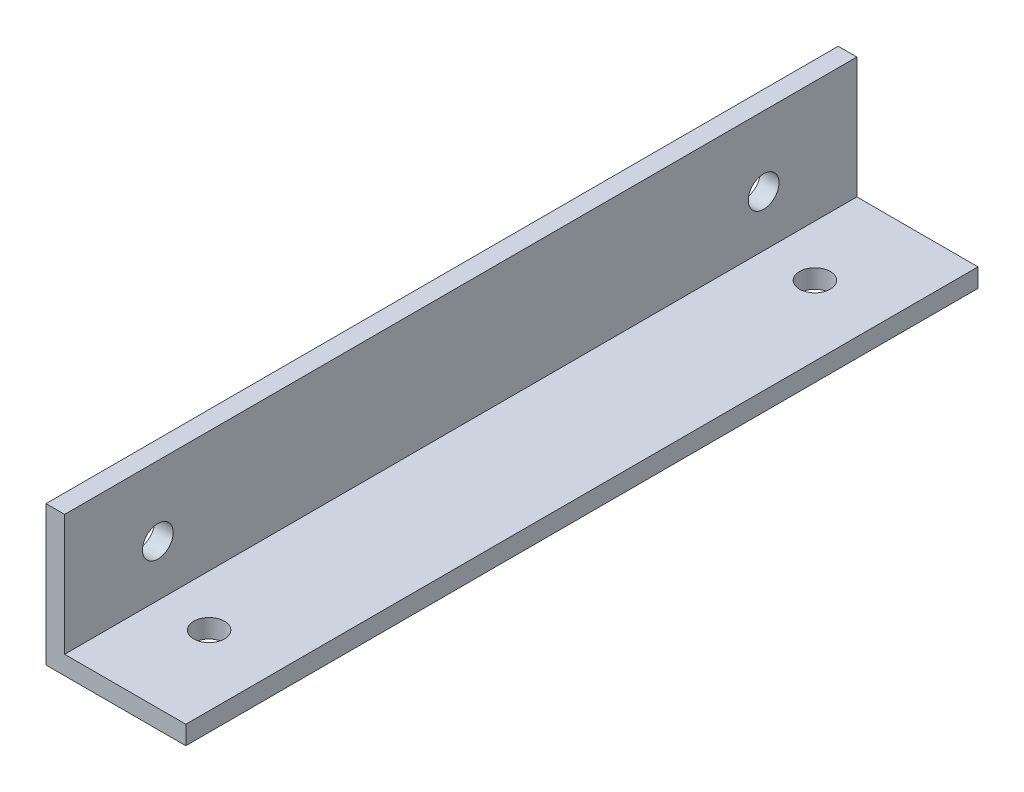
ISO-10303-21;
HEADER;
FILE_DESCRIPTION(('STEP AP214'),'2;1');
FILE_NAME('part.step','',(''),(''),'','','');
FILE_SCHEMA(('AUTOMOTIVE_DESIGN { 1 0 10303 214 1 1 1 1 }'));
ENDSEC;
DATA;
#1=APPLICATION_CONTEXT('core data for automotive mechanical design processes');
#2=APPLICATION_PROTOCOL_DEFINITION('international standard','automotive_design',2000,#1);
#3=PRODUCT_CONTEXT('',#1,'mechanical');
#4=PRODUCT('Part','Part','',(#3));
#5=PRODUCT_RELATED_PRODUCT_CATEGORY('part','',(#4));
#6=PRODUCT_DEFINITION_FORMATION('','',#4);
#7=PRODUCT_DEFINITION_CONTEXT('part definition',#1,'design');
#8=PRODUCT_DEFINITION('design','',#6,#7);
#9=PRODUCT_DEFINITION_SHAPE('','',#8);
#10=(LENGTH_UNIT() NAMED_UNIT(*) SI_UNIT(.MILLI.,.METRE.));
#11=(NAMED_UNIT(*) PLANE_ANGLE_UNIT() SI_UNIT($,.RADIAN.));
#12=(NAMED_UNIT(*) SI_UNIT($,.STERADIAN.) SOLID_ANGLE_UNIT());
#13=UNCERTAINTY_MEASURE_WITH_UNIT(LENGTH_MEASURE(1.E-05),#10,'distance_accuracy_value','');
#14=(GEOMETRIC_REPRESENTATION_CONTEXT(3) GLOBAL_UNCERTAINTY_ASSIGNED_CONTEXT((#13)) GLOBAL_UNIT_ASSIGNED_CONTEXT((#10,
#11,#12)) REPRESENTATION_CONTEXT('',''));
#15=CARTESIAN_POINT('',(0.,0.,0.));
#16=DIRECTION('',(0.,0.,1.));
#17=DIRECTION('',(1.,0.,0.));
#18=AXIS2_PLACEMENT_3D('',#15,#16,#17);
#19=CARTESIAN_POINT('',(15.,0.,85.));
#20=DIRECTION('',(0.,1.,0.));
#21=DIRECTION('',(0.,0.,1.));
#22=AXIS2_PLACEMENT_3D('',#19,#20,#21);
#23=PLANE('',#22);
#24=CARTESIAN_POINT('',(7.5,0.,75.));
#25=DIRECTION('',(0.,-1.,0.));
#26=DIRECTION('',(0.,0.,-1.));
#27=AXIS2_PLACEMENT_3D('',#24,#25,#26);
#28=CIRCLE('',#27,1.64999999999999);
#29=CARTESIAN_POINT('',(7.5,0.,73.35));
#30=VERTEX_POINT('',#29);
#31=EDGE_CURVE('E167',#30,#30,#28,.T.);
#32=ORIENTED_EDGE('',*,*,#31,.F.);
#33=EDGE_LOOP('',(#32));
#34=FACE_BOUND('',#33,.T.);
#35=CARTESIAN_POINT('',(7.5,0.,10.));
#36=DIRECTION('',(0.,-1.,0.));
#37=DIRECTION('',(0.,0.,-1.));
#38=AXIS2_PLACEMENT_3D('',#35,#36,#37);
#39=CIRCLE('',#38,1.64999999999999);
#40=CARTESIAN_POINT('',(7.5,0.,8.35000000000001));
#41=VERTEX_POINT('',#40);
#42=EDGE_CURVE('E170',#41,#41,#39,.T.);
#43=ORIENTED_EDGE('',*,*,#42,.F.);
#44=EDGE_LOOP('',(#43));
#45=FACE_BOUND('',#44,.T.);
#46=DIRECTION('',(1.,0.,0.));
#47=VECTOR('',#46,1.);
#48=CARTESIAN_POINT('',(15.,0.,0.));
#49=LINE('',#48,#47);
#50=CARTESIAN_POINT('',(0.,0.,0.));
#51=VERTEX_POINT('',#50);
#52=CARTESIAN_POINT('',(15.,0.,0.));
#53=VERTEX_POINT('',#52);
#54=EDGE_CURVE('E120',#51,#53,#49,.T.);
#55=ORIENTED_EDGE('',*,*,#54,.T.);
#56=DIRECTION('',(0.,0.,-1.));
#57=VECTOR('',#56,1.);
#58=CARTESIAN_POINT('',(15.,0.,85.));
#59=LINE('',#58,#57);
#60=CARTESIAN_POINT('',(15.,0.,85.));
#61=VERTEX_POINT('',#60);
#62=EDGE_CURVE('E11',#61,#53,#59,.T.);
#63=ORIENTED_EDGE('',*,*,#62,.F.);
#64=DIRECTION('',(1.,0.,0.));
#65=VECTOR('',#64,1.);
#66=CARTESIAN_POINT('',(15.,0.,85.));
#67=LINE('',#66,#65);
#68=CARTESIAN_POINT('',(0.,0.,85.));
#69=VERTEX_POINT('',#68);
#70=EDGE_CURVE('E131',#69,#61,#67,.T.);
#71=ORIENTED_EDGE('',*,*,#70,.F.);
#72=DIRECTION('',(0.,0.,-1.));
#73=VECTOR('',#72,1.);
#74=CARTESIAN_POINT('',(0.,0.,85.));
#75=LINE('',#74,#73);
#76=EDGE_CURVE('E116',#69,#51,#75,.T.);
#77=ORIENTED_EDGE('',*,*,#76,.T.);
#78=EDGE_LOOP('',(#55,#63,#71,#77));
#79=FACE_BOUND('',#78,.T.);
#80=ADVANCED_FACE('F35',(#34,#45,#79),#23,.F.);
#81=CARTESIAN_POINT('',(15.,2.,85.));
#82=DIRECTION('',(-1.,0.,0.));
#83=DIRECTION('',(0.,-1.,0.));
#84=AXIS2_PLACEMENT_3D('',#81,#82,#83);
#85=PLANE('',#84);
#86=DIRECTION('',(0.,1.,0.));
#87=VECTOR('',#86,1.);
#88=CARTESIAN_POINT('',(15.,2.,0.));
#89=LINE('',#88,#87);
#90=CARTESIAN_POINT('',(15.,2.,0.));
#91=VERTEX_POINT('',#90);
#92=EDGE_CURVE('E123',#53,#91,#89,.T.);
#93=ORIENTED_EDGE('',*,*,#92,.T.);
#94=DIRECTION('',(0.,0.,-1.));
#95=VECTOR('',#94,1.);
#96=CARTESIAN_POINT('',(15.,2.,85.));
#97=LINE('',#96,#95);
#98=CARTESIAN_POINT('',(15.,2.,85.));
#99=VERTEX_POINT('',#98);
#100=EDGE_CURVE('E44',#99,#91,#97,.T.);
#101=ORIENTED_EDGE('',*,*,#100,.F.);
#102=DIRECTION('',(0.,1.,0.));
#103=VECTOR('',#102,1.);
#104=CARTESIAN_POINT('',(15.,2.,85.));
#105=LINE('',#104,#103);
#106=EDGE_CURVE('E89',#61,#99,#105,.T.);
#107=ORIENTED_EDGE('',*,*,#106,.F.);
#108=ORIENTED_EDGE('',*,*,#62,.T.);
#109=EDGE_LOOP('',(#93,#101,#107,#108));
#110=FACE_BOUND('',#109,.T.);
#111=ADVANCED_FACE('F159',(#110),#85,.F.);
#112=CARTESIAN_POINT('',(2.,2.,85.));
#113=DIRECTION('',(0.,-1.,0.));
#114=DIRECTION('',(0.,0.,-1.));
#115=AXIS2_PLACEMENT_3D('',#112,#113,#114);
#116=PLANE('',#115);
#117=CARTESIAN_POINT('',(7.5,2.,75.));
#118=DIRECTION('',(0.,-1.,0.));
#119=DIRECTION('',(0.,0.,-1.));
#120=AXIS2_PLACEMENT_3D('',#117,#118,#119);
#121=CIRCLE('',#120,1.64999999999999);
#122=CARTESIAN_POINT('',(7.5,2.,73.35));
#123=VERTEX_POINT('',#122);
#124=EDGE_CURVE('E173',#123,#123,#121,.T.);
#125=ORIENTED_EDGE('',*,*,#124,.T.);
#126=EDGE_LOOP('',(#125));
#127=FACE_BOUND('',#126,.T.);
#128=CARTESIAN_POINT('',(7.5,2.,10.));
#129=DIRECTION('',(0.,-1.,0.));
#130=DIRECTION('',(0.,0.,-1.));
#131=AXIS2_PLACEMENT_3D('',#128,#129,#130);
#132=CIRCLE('',#131,1.64999999999999);
#133=CARTESIAN_POINT('',(7.5,2.,8.35000000000001));
#134=VERTEX_POINT('',#133);
#135=EDGE_CURVE('E172',#134,#134,#132,.T.);
#136=ORIENTED_EDGE('',*,*,#135,.T.);
#137=EDGE_LOOP('',(#136));
#138=FACE_BOUND('',#137,.T.);
#139=DIRECTION('',(-1.,0.,0.));
#140=VECTOR('',#139,1.);
#141=CARTESIAN_POINT('',(2.,2.,0.));
#142=LINE('',#141,#140);
#143=CARTESIAN_POINT('',(2.,2.,0.));
#144=VERTEX_POINT('',#143);
#145=EDGE_CURVE('E126',#91,#144,#142,.T.);
#146=ORIENTED_EDGE('',*,*,#145,.T.);
#147=DIRECTION('',(0.,0.,-1.));
#148=VECTOR('',#147,1.);
#149=CARTESIAN_POINT('',(2.,2.,85.));
#150=LINE('',#149,#148);
#151=CARTESIAN_POINT('',(2.,2.,85.));
#152=VERTEX_POINT('',#151);
#153=EDGE_CURVE('E111',#152,#144,#150,.T.);
#154=ORIENTED_EDGE('',*,*,#153,.F.);
#155=DIRECTION('',(-1.,0.,0.));
#156=VECTOR('',#155,1.);
#157=CARTESIAN_POINT('',(2.,2.,85.));
#158=LINE('',#157,#156);
#159=EDGE_CURVE('E102',#99,#152,#158,.T.);
#160=ORIENTED_EDGE('',*,*,#159,.F.);
#161=ORIENTED_EDGE('',*,*,#100,.T.);
#162=EDGE_LOOP('',(#146,#154,#160,#161));
#163=FACE_BOUND('',#162,.T.);
#164=ADVANCED_FACE('F138',(#127,#138,#163),#116,.F.);
#165=CARTESIAN_POINT('',(2.,15.,85.));
#166=DIRECTION('',(-1.,0.,0.));
#167=DIRECTION('',(0.,-1.,0.));
#168=AXIS2_PLACEMENT_3D('',#165,#166,#167);
#169=PLANE('',#168);
#170=CARTESIAN_POINT('',(2.,7.5,75.));
#171=DIRECTION('',(-1.,0.,0.));
#172=DIRECTION('',(0.,-1.,0.));
#173=AXIS2_PLACEMENT_3D('',#170,#171,#172);
#174=CIRCLE('',#173,1.64999999999999);
#175=CARTESIAN_POINT('',(2.,5.85000000000001,75.));
#176=VERTEX_POINT('',#175);
#177=EDGE_CURVE('E38',#176,#176,#174,.T.);
#178=ORIENTED_EDGE('',*,*,#177,.T.);
#179=EDGE_LOOP('',(#178));
#180=FACE_BOUND('',#179,.T.);
#181=CARTESIAN_POINT('',(2.,7.5,10.));
#182=DIRECTION('',(-1.,0.,0.));
#183=DIRECTION('',(0.,-1.,0.));
#184=AXIS2_PLACEMENT_3D('',#181,#182,#183);
#185=CIRCLE('',#184,1.64999999999999);
#186=CARTESIAN_POINT('',(2.,5.85000000000001,10.));
#187=VERTEX_POINT('',#186);
#188=EDGE_CURVE('E124',#187,#187,#185,.T.);
#189=ORIENTED_EDGE('',*,*,#188,.T.);
#190=EDGE_LOOP('',(#189));
#191=FACE_BOUND('',#190,.T.);
#192=DIRECTION('',(0.,1.,0.));
#193=VECTOR('',#192,1.);
#194=CARTESIAN_POINT('',(2.,15.,0.));
#195=LINE('',#194,#193);
#196=CARTESIAN_POINT('',(2.,15.,0.));
#197=VERTEX_POINT('',#196);
#198=EDGE_CURVE('E110',#144,#197,#195,.T.);
#199=ORIENTED_EDGE('',*,*,#198,.T.);
#200=DIRECTION('',(0.,0.,-1.));
#201=VECTOR('',#200,1.);
#202=CARTESIAN_POINT('',(2.,15.,85.));
#203=LINE('',#202,#201);
#204=CARTESIAN_POINT('',(2.,15.,85.));
#205=VERTEX_POINT('',#204);
#206=EDGE_CURVE('E107',#205,#197,#203,.T.);
#207=ORIENTED_EDGE('',*,*,#206,.F.);
#208=DIRECTION('',(0.,1.,0.));
#209=VECTOR('',#208,1.);
#210=CARTESIAN_POINT('',(2.,15.,85.));
#211=LINE('',#210,#209);
#212=EDGE_CURVE('E96',#152,#205,#211,.T.);
#213=ORIENTED_EDGE('',*,*,#212,.F.);
#214=ORIENTED_EDGE('',*,*,#153,.T.);
#215=EDGE_LOOP('',(#199,#207,#213,#214));
#216=FACE_BOUND('',#215,.T.);
#217=ADVANCED_FACE('F108',(#180,#191,#216),#169,.F.);
#218=CARTESIAN_POINT('',(0.,15.,85.));
#219=DIRECTION('',(0.,-1.,0.));
#220=DIRECTION('',(0.,0.,-1.));
#221=AXIS2_PLACEMENT_3D('',#218,#219,#220);
#222=PLANE('',#221);
#223=DIRECTION('',(-1.,0.,0.));
#224=VECTOR('',#223,1.);
#225=CARTESIAN_POINT('',(0.,15.,0.));
#226=LINE('',#225,#224);
#227=CARTESIAN_POINT('',(0.,15.,0.));
#228=VERTEX_POINT('',#227);
#229=EDGE_CURVE('E75',#197,#228,#226,.T.);
#230=ORIENTED_EDGE('',*,*,#229,.T.);
#231=DIRECTION('',(0.,0.,-1.));
#232=VECTOR('',#231,1.);
#233=CARTESIAN_POINT('',(0.,15.,85.));
#234=LINE('',#233,#232);
#235=CARTESIAN_POINT('',(0.,15.,85.));
#236=VERTEX_POINT('',#235);
#237=EDGE_CURVE('E112',#236,#228,#234,.T.);
#238=ORIENTED_EDGE('',*,*,#237,.F.);
#239=DIRECTION('',(-1.,0.,0.));
#240=VECTOR('',#239,1.);
#241=CARTESIAN_POINT('',(0.,15.,85.));
#242=LINE('',#241,#240);
#243=EDGE_CURVE('E100',#205,#236,#242,.T.);
#244=ORIENTED_EDGE('',*,*,#243,.F.);
#245=ORIENTED_EDGE('',*,*,#206,.T.);
#246=EDGE_LOOP('',(#230,#238,#244,#245));
#247=FACE_BOUND('',#246,.T.);
#248=ADVANCED_FACE('F114',(#247),#222,.F.);
#249=CARTESIAN_POINT('',(0.,0.,85.));
#250=DIRECTION('',(1.,0.,0.));
#251=DIRECTION('',(0.,0.,-1.));
#252=AXIS2_PLACEMENT_3D('',#249,#250,#251);
#253=PLANE('',#252);
#254=CARTESIAN_POINT('',(0.,7.5,75.));
#255=DIRECTION('',(-1.,0.,0.));
#256=DIRECTION('',(0.,0.,1.));
#257=AXIS2_PLACEMENT_3D('',#254,#255,#256);
#258=CIRCLE('',#257,1.64999999999999);
#259=CARTESIAN_POINT('',(0.,7.5,76.65));
#260=VERTEX_POINT('',#259);
#261=EDGE_CURVE('E212',#260,#260,#258,.T.);
#262=ORIENTED_EDGE('',*,*,#261,.F.);
#263=EDGE_LOOP('',(#262));
#264=FACE_BOUND('',#263,.T.);
#265=CARTESIAN_POINT('',(0.,7.5,10.));
#266=DIRECTION('',(-1.,0.,0.));
#267=DIRECTION('',(0.,0.,1.));
#268=AXIS2_PLACEMENT_3D('',#265,#266,#267);
#269=CIRCLE('',#268,1.64999999999999);
#270=CARTESIAN_POINT('',(0.,7.5,11.65));
#271=VERTEX_POINT('',#270);
#272=EDGE_CURVE('E176',#271,#271,#269,.T.);
#273=ORIENTED_EDGE('',*,*,#272,.F.);
#274=EDGE_LOOP('',(#273));
#275=FACE_BOUND('',#274,.T.);
#276=DIRECTION('',(0.,-1.,0.));
#277=VECTOR('',#276,1.);
#278=CARTESIAN_POINT('',(0.,0.,0.));
#279=LINE('',#278,#277);
#280=EDGE_CURVE('E81',#228,#51,#279,.T.);
#281=ORIENTED_EDGE('',*,*,#280,.T.);
#282=ORIENTED_EDGE('',*,*,#76,.F.);
#283=DIRECTION('',(0.,-1.,0.));
#284=VECTOR('',#283,1.);
#285=CARTESIAN_POINT('',(0.,0.,85.));
#286=LINE('',#285,#284);
#287=EDGE_CURVE('E52',#236,#69,#286,.T.);
#288=ORIENTED_EDGE('',*,*,#287,.F.);
#289=ORIENTED_EDGE('',*,*,#237,.T.);
#290=EDGE_LOOP('',(#281,#282,#288,#289));
#291=FACE_BOUND('',#290,.T.);
#292=ADVANCED_FACE('F145',(#264,#275,#291),#253,.F.);
#293=CARTESIAN_POINT('',(0.,0.,85.));
#294=DIRECTION('',(0.,0.,-1.));
#295=DIRECTION('',(-1.,0.,0.));
#296=AXIS2_PLACEMENT_3D('',#293,#294,#295);
#297=PLANE('',#296);
#298=ORIENTED_EDGE('',*,*,#70,.T.);
#299=ORIENTED_EDGE('',*,*,#106,.T.);
#300=ORIENTED_EDGE('',*,*,#159,.T.);
#301=ORIENTED_EDGE('',*,*,#212,.T.);
#302=ORIENTED_EDGE('',*,*,#243,.T.);
#303=ORIENTED_EDGE('',*,*,#287,.T.);
#304=EDGE_LOOP('',(#298,#299,#300,#301,#302,#303));
#305=FACE_BOUND('',#304,.T.);
#306=ADVANCED_FACE('F98',(#305),#297,.F.);
#307=CARTESIAN_POINT('',(0.,0.,0.));
#308=DIRECTION('',(0.,0.,-1.));
#309=DIRECTION('',(-1.,0.,0.));
#310=AXIS2_PLACEMENT_3D('',#307,#308,#309);
#311=PLANE('',#310);
#312=ORIENTED_EDGE('',*,*,#54,.F.);
#313=ORIENTED_EDGE('',*,*,#280,.F.);
#314=ORIENTED_EDGE('',*,*,#229,.F.);
#315=ORIENTED_EDGE('',*,*,#198,.F.);
#316=ORIENTED_EDGE('',*,*,#145,.F.);
#317=ORIENTED_EDGE('',*,*,#92,.F.);
#318=EDGE_LOOP('',(#312,#313,#314,#315,#316,#317));
#319=FACE_BOUND('',#318,.T.);
#320=ADVANCED_FACE('F141',(#319),#311,.T.);
#321=CARTESIAN_POINT('',(0.,7.5,10.));
#322=DIRECTION('',(-1.,0.,0.));
#323=DIRECTION('',(0.,0.,1.));
#324=AXIS2_PLACEMENT_3D('',#321,#322,#323);
#325=CYLINDRICAL_SURFACE('',#324,1.64999999999999);
#326=ORIENTED_EDGE('',*,*,#272,.T.);
#327=EDGE_LOOP('',(#326));
#328=FACE_BOUND('',#327,.T.);
#329=ORIENTED_EDGE('',*,*,#188,.F.);
#330=EDGE_LOOP('',(#329));
#331=FACE_BOUND('',#330,.T.);
#332=ADVANCED_FACE('F190',(#328,#331),#325,.F.);
#333=CARTESIAN_POINT('',(7.5,0.,10.));
#334=DIRECTION('',(0.,-1.,0.));
#335=DIRECTION('',(0.,0.,-1.));
#336=AXIS2_PLACEMENT_3D('',#333,#334,#335);
#337=CYLINDRICAL_SURFACE('',#336,1.64999999999999);
#338=ORIENTED_EDGE('',*,*,#42,.T.);
#339=EDGE_LOOP('',(#338));
#340=FACE_BOUND('',#339,.T.);
#341=ORIENTED_EDGE('',*,*,#135,.F.);
#342=EDGE_LOOP('',(#341));
#343=FACE_BOUND('',#342,.T.);
#344=ADVANCED_FACE('F192',(#340,#343),#337,.F.);
#345=CARTESIAN_POINT('',(7.5,0.,75.));
#346=DIRECTION('',(0.,-1.,0.));
#347=DIRECTION('',(0.,0.,-1.));
#348=AXIS2_PLACEMENT_3D('',#345,#346,#347);
#349=CYLINDRICAL_SURFACE('',#348,1.64999999999999);
#350=ORIENTED_EDGE('',*,*,#31,.T.);
#351=EDGE_LOOP('',(#350));
#352=FACE_BOUND('',#351,.T.);
#353=ORIENTED_EDGE('',*,*,#124,.F.);
#354=EDGE_LOOP('',(#353));
#355=FACE_BOUND('',#354,.T.);
#356=ADVANCED_FACE('F199',(#352,#355),#349,.F.);
#357=CARTESIAN_POINT('',(0.,7.5,75.));
#358=DIRECTION('',(-1.,0.,0.));
#359=DIRECTION('',(0.,0.,1.));
#360=AXIS2_PLACEMENT_3D('',#357,#358,#359);
#361=CYLINDRICAL_SURFACE('',#360,1.64999999999999);
#362=ORIENTED_EDGE('',*,*,#261,.T.);
#363=EDGE_LOOP('',(#362));
#364=FACE_BOUND('',#363,.T.);
#365=ORIENTED_EDGE('',*,*,#177,.F.);
#366=EDGE_LOOP('',(#365));
#367=FACE_BOUND('',#366,.T.);
#368=ADVANCED_FACE('F204',(#364,#367),#361,.F.);
#369=CLOSED_SHELL('',(#80,#111,#164,#217,#248,#292,#306,#320,#332,#344,#356,#368));
#370=MANIFOLD_SOLID_BREP('B2',#369);
#371=ADVANCED_BREP_SHAPE_REPRESENTATION('',(#18,#370),#14);
#372=SHAPE_DEFINITION_REPRESENTATION(#9,#371);
ENDSEC;
END-ISO-10303-21;
